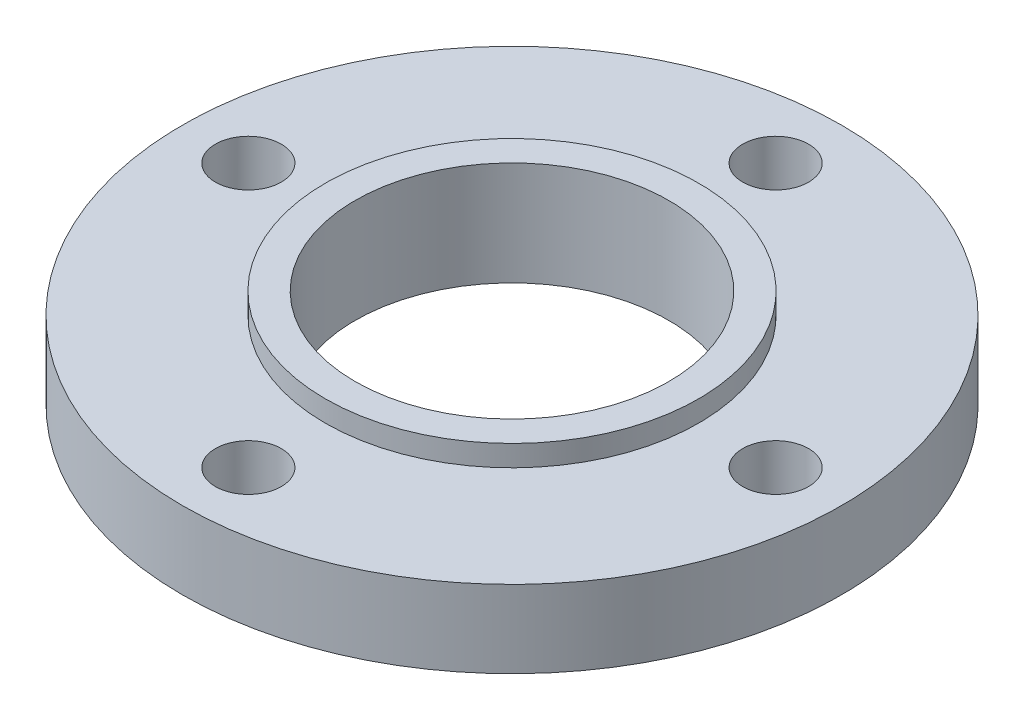
ISO-10303-21;
HEADER;
FILE_DESCRIPTION(('STEP AP214'),'2;1');
FILE_NAME('part.step','',(''),(''),'','','');
FILE_SCHEMA(('AUTOMOTIVE_DESIGN { 1 0 10303 214 1 1 1 1 }'));
ENDSEC;
DATA;
#1=APPLICATION_CONTEXT('core data for automotive mechanical design processes');
#2=APPLICATION_PROTOCOL_DEFINITION('international standard','automotive_design',2000,#1);
#3=PRODUCT_CONTEXT('',#1,'mechanical');
#4=PRODUCT('Part','Part','',(#3));
#5=PRODUCT_RELATED_PRODUCT_CATEGORY('part','',(#4));
#6=PRODUCT_DEFINITION_FORMATION('','',#4);
#7=PRODUCT_DEFINITION_CONTEXT('part definition',#1,'design');
#8=PRODUCT_DEFINITION('design','',#6,#7);
#9=PRODUCT_DEFINITION_SHAPE('','',#8);
#10=(LENGTH_UNIT() NAMED_UNIT(*) SI_UNIT(.MILLI.,.METRE.));
#11=(NAMED_UNIT(*) PLANE_ANGLE_UNIT() SI_UNIT($,.RADIAN.));
#12=(NAMED_UNIT(*) SI_UNIT($,.STERADIAN.) SOLID_ANGLE_UNIT());
#13=UNCERTAINTY_MEASURE_WITH_UNIT(LENGTH_MEASURE(1.E-05),#10,'distance_accuracy_value','');
#14=(GEOMETRIC_REPRESENTATION_CONTEXT(3) GLOBAL_UNCERTAINTY_ASSIGNED_CONTEXT((#13)) GLOBAL_UNIT_ASSIGNED_CONTEXT((#10,
#11,#12)) REPRESENTATION_CONTEXT('',''));
#15=CARTESIAN_POINT('',(0.,0.,0.));
#16=DIRECTION('',(0.,0.,1.));
#17=DIRECTION('',(1.,0.,0.));
#18=AXIS2_PLACEMENT_3D('',#15,#16,#17);
#19=CARTESIAN_POINT('',(0.,11.3909185591856,0.));
#20=DIRECTION('',(0.,-1.,0.));
#21=DIRECTION('',(0.,0.,-1.));
#22=AXIS2_PLACEMENT_3D('',#19,#20,#21);
#23=CYLINDRICAL_SURFACE('',#22,95.25);
#24=CARTESIAN_POINT('',(0.,11.3909185591856,0.));
#25=DIRECTION('',(0.,1.,0.));
#26=DIRECTION('',(0.,0.,1.));
#27=AXIS2_PLACEMENT_3D('',#24,#25,#26);
#28=CIRCLE('',#27,95.25);
#29=CARTESIAN_POINT('',(0.,11.3909185591856,95.25));
#30=VERTEX_POINT('',#29);
#31=EDGE_CURVE('E10',#30,#30,#28,.T.);
#32=ORIENTED_EDGE('',*,*,#31,.F.);
#33=EDGE_LOOP('',(#32));
#34=FACE_BOUND('',#33,.T.);
#35=CARTESIAN_POINT('',(0.,-10.9610814408144,0.));
#36=DIRECTION('',(0.,1.,0.));
#37=DIRECTION('',(0.,0.,1.));
#38=AXIS2_PLACEMENT_3D('',#35,#36,#37);
#39=CIRCLE('',#38,95.25);
#40=CARTESIAN_POINT('',(0.,-10.9610814408144,95.25));
#41=VERTEX_POINT('',#40);
#42=EDGE_CURVE('E41',#41,#41,#39,.T.);
#43=ORIENTED_EDGE('',*,*,#42,.T.);
#44=EDGE_LOOP('',(#43));
#45=FACE_BOUND('',#44,.T.);
#46=ADVANCED_FACE('F34',(#34,#45),#23,.T.);
#47=CARTESIAN_POINT('',(0.,11.3909185591856,0.));
#48=DIRECTION('',(0.,1.,0.));
#49=DIRECTION('',(0.,0.,1.));
#50=AXIS2_PLACEMENT_3D('',#47,#48,#49);
#51=PLANE('',#50);
#52=CARTESIAN_POINT('',(76.2,11.3909185591856,2.58381330109108E-13));
#53=DIRECTION('',(0.,1.,0.));
#54=DIRECTION('',(0.,0.,1.));
#55=AXIS2_PLACEMENT_3D('',#52,#53,#54);
#56=CIRCLE('',#55,9.525);
#57=CARTESIAN_POINT('',(76.2,11.3909185591856,9.52500000000026));
#58=VERTEX_POINT('',#57);
#59=EDGE_CURVE('E68',#58,#58,#56,.F.);
#60=ORIENTED_EDGE('',*,*,#59,.T.);
#61=EDGE_LOOP('',(#60));
#62=FACE_BOUND('',#61,.T.);
#63=CARTESIAN_POINT('',(0.,11.3909185591856,76.2));
#64=DIRECTION('',(0.,1.,0.));
#65=DIRECTION('',(0.,0.,1.));
#66=AXIS2_PLACEMENT_3D('',#63,#64,#65);
#67=CIRCLE('',#66,9.525);
#68=CARTESIAN_POINT('',(0.,11.3909185591856,85.725));
#69=VERTEX_POINT('',#68);
#70=EDGE_CURVE('E71',#69,#69,#67,.F.);
#71=ORIENTED_EDGE('',*,*,#70,.T.);
#72=EDGE_LOOP('',(#71));
#73=FACE_BOUND('',#72,.T.);
#74=CARTESIAN_POINT('',(-76.2,11.3909185591856,-8.05822181970279E-13));
#75=DIRECTION('',(0.,1.,0.));
#76=DIRECTION('',(0.,0.,1.));
#77=AXIS2_PLACEMENT_3D('',#74,#75,#76);
#78=CIRCLE('',#77,9.525);
#79=CARTESIAN_POINT('',(-76.2,11.3909185591856,9.52499999999919));
#80=VERTEX_POINT('',#79);
#81=EDGE_CURVE('E74',#80,#80,#78,.F.);
#82=ORIENTED_EDGE('',*,*,#81,.T.);
#83=EDGE_LOOP('',(#82));
#84=FACE_BOUND('',#83,.T.);
#85=CARTESIAN_POINT('',(0.,11.3909185591856,-76.2));
#86=DIRECTION('',(0.,1.,0.));
#87=DIRECTION('',(0.,0.,1.));
#88=AXIS2_PLACEMENT_3D('',#85,#86,#87);
#89=CIRCLE('',#88,9.525);
#90=CARTESIAN_POINT('',(0.,11.3909185591856,-66.675));
#91=VERTEX_POINT('',#90);
#92=EDGE_CURVE('E62',#91,#91,#89,.F.);
#93=ORIENTED_EDGE('',*,*,#92,.T.);
#94=EDGE_LOOP('',(#93));
#95=FACE_BOUND('',#94,.T.);
#96=CARTESIAN_POINT('',(0.,11.3909185591856,0.));
#97=DIRECTION('',(0.,1.,0.));
#98=DIRECTION('',(0.,0.,1.));
#99=AXIS2_PLACEMENT_3D('',#96,#97,#98);
#100=CIRCLE('',#99,53.975);
#101=CARTESIAN_POINT('',(0.,11.3909185591856,53.975));
#102=VERTEX_POINT('',#101);
#103=EDGE_CURVE('E46',#102,#102,#100,.F.);
#104=ORIENTED_EDGE('',*,*,#103,.T.);
#105=EDGE_LOOP('',(#104));
#106=FACE_BOUND('',#105,.T.);
#107=ORIENTED_EDGE('',*,*,#31,.T.);
#108=EDGE_LOOP('',(#107));
#109=FACE_BOUND('',#108,.T.);
#110=ADVANCED_FACE('F103',(#62,#73,#84,#95,#106,#109),#51,.T.);
#111=CARTESIAN_POINT('',(0.,-10.9610814408144,0.));
#112=DIRECTION('',(0.,1.,0.));
#113=DIRECTION('',(0.,0.,1.));
#114=AXIS2_PLACEMENT_3D('',#111,#112,#113);
#115=PLANE('',#114);
#116=CARTESIAN_POINT('',(76.2,-10.9610814408144,2.58381330109108E-13));
#117=DIRECTION('',(0.,1.,0.));
#118=DIRECTION('',(-1.,0.,0.));
#119=AXIS2_PLACEMENT_3D('',#116,#117,#118);
#120=CIRCLE('',#119,9.525);
#121=CARTESIAN_POINT('',(66.675,-10.9610814408144,2.25124970356627E-13));
#122=VERTEX_POINT('',#121);
#123=EDGE_CURVE('E77',#122,#122,#120,.T.);
#124=ORIENTED_EDGE('',*,*,#123,.T.);
#125=EDGE_LOOP('',(#124));
#126=FACE_BOUND('',#125,.T.);
#127=CARTESIAN_POINT('',(0.,-10.9610814408144,76.2));
#128=DIRECTION('',(0.,1.,0.));
#129=DIRECTION('',(0.,0.,-1.));
#130=AXIS2_PLACEMENT_3D('',#127,#128,#129);
#131=CIRCLE('',#130,9.525);
#132=CARTESIAN_POINT('',(0.,-10.9610814408144,66.675));
#133=VERTEX_POINT('',#132);
#134=EDGE_CURVE('E81',#133,#133,#131,.T.);
#135=ORIENTED_EDGE('',*,*,#134,.T.);
#136=EDGE_LOOP('',(#135));
#137=FACE_BOUND('',#136,.T.);
#138=CARTESIAN_POINT('',(-76.2,-10.9610814408144,-8.05822181970279E-13));
#139=DIRECTION('',(0.,1.,0.));
#140=DIRECTION('',(1.,0.,0.));
#141=AXIS2_PLACEMENT_3D('',#138,#139,#140);
#142=CIRCLE('',#141,9.525);
#143=CARTESIAN_POINT('',(-66.675,-10.9610814408144,-7.06053102712836E-13));
#144=VERTEX_POINT('',#143);
#145=EDGE_CURVE('E78',#144,#144,#142,.T.);
#146=ORIENTED_EDGE('',*,*,#145,.T.);
#147=EDGE_LOOP('',(#146));
#148=FACE_BOUND('',#147,.T.);
#149=CARTESIAN_POINT('',(0.,-10.9610814408144,-76.2));
#150=DIRECTION('',(0.,1.,0.));
#151=DIRECTION('',(0.,0.,1.));
#152=AXIS2_PLACEMENT_3D('',#149,#150,#151);
#153=CIRCLE('',#152,9.525);
#154=CARTESIAN_POINT('',(0.,-10.9610814408144,-66.675));
#155=VERTEX_POINT('',#154);
#156=EDGE_CURVE('E65',#155,#155,#153,.T.);
#157=ORIENTED_EDGE('',*,*,#156,.T.);
#158=EDGE_LOOP('',(#157));
#159=FACE_BOUND('',#158,.T.);
#160=CARTESIAN_POINT('',(0.,-10.9610814408144,0.));
#161=DIRECTION('',(0.,1.,0.));
#162=DIRECTION('',(0.,0.,1.));
#163=AXIS2_PLACEMENT_3D('',#160,#161,#162);
#164=CIRCLE('',#163,63.5);
#165=CARTESIAN_POINT('',(0.,-10.9610814408144,63.5));
#166=VERTEX_POINT('',#165);
#167=EDGE_CURVE('E54',#166,#166,#164,.T.);
#168=ORIENTED_EDGE('',*,*,#167,.T.);
#169=EDGE_LOOP('',(#168));
#170=FACE_BOUND('',#169,.T.);
#171=ORIENTED_EDGE('',*,*,#42,.F.);
#172=EDGE_LOOP('',(#171));
#173=FACE_BOUND('',#172,.T.);
#174=ADVANCED_FACE('F87',(#126,#137,#148,#159,#170,#173),#115,.F.);
#175=CARTESIAN_POINT('',(0.,17.4869185591856,0.));
#176=DIRECTION('',(0.,-1.,0.));
#177=DIRECTION('',(0.,0.,-1.));
#178=AXIS2_PLACEMENT_3D('',#175,#176,#177);
#179=CYLINDRICAL_SURFACE('',#178,53.975);
#180=ORIENTED_EDGE('',*,*,#103,.F.);
#181=EDGE_LOOP('',(#180));
#182=FACE_BOUND('',#181,.T.);
#183=CARTESIAN_POINT('',(0.,17.4869185591856,0.));
#184=DIRECTION('',(0.,1.,0.));
#185=DIRECTION('',(0.,0.,1.));
#186=AXIS2_PLACEMENT_3D('',#183,#184,#185);
#187=CIRCLE('',#186,53.975);
#188=CARTESIAN_POINT('',(0.,17.4869185591856,53.975));
#189=VERTEX_POINT('',#188);
#190=EDGE_CURVE('E50',#189,#189,#187,.T.);
#191=ORIENTED_EDGE('',*,*,#190,.F.);
#192=EDGE_LOOP('',(#191));
#193=FACE_BOUND('',#192,.T.);
#194=ADVANCED_FACE('F114',(#182,#193),#179,.T.);
#195=CARTESIAN_POINT('',(0.,17.4869185591856,0.));
#196=DIRECTION('',(0.,1.,0.));
#197=DIRECTION('',(0.,0.,1.));
#198=AXIS2_PLACEMENT_3D('',#195,#196,#197);
#199=PLANE('',#198);
#200=CARTESIAN_POINT('',(0.,17.4869185591856,0.));
#201=DIRECTION('',(0.,1.,0.));
#202=DIRECTION('',(0.,0.,1.));
#203=AXIS2_PLACEMENT_3D('',#200,#201,#202);
#204=CIRCLE('',#203,45.339);
#205=CARTESIAN_POINT('',(0.,17.4869185591856,45.339));
#206=VERTEX_POINT('',#205);
#207=EDGE_CURVE('E57',#206,#206,#204,.F.);
#208=ORIENTED_EDGE('',*,*,#207,.T.);
#209=EDGE_LOOP('',(#208));
#210=FACE_BOUND('',#209,.T.);
#211=ORIENTED_EDGE('',*,*,#190,.T.);
#212=EDGE_LOOP('',(#211));
#213=FACE_BOUND('',#212,.T.);
#214=ADVANCED_FACE('F118',(#210,#213),#199,.T.);
#215=CARTESIAN_POINT('',(0.,-12.5485814408144,0.));
#216=DIRECTION('',(0.,1.,0.));
#217=DIRECTION('',(0.,0.,1.));
#218=AXIS2_PLACEMENT_3D('',#215,#216,#217);
#219=CYLINDRICAL_SURFACE('',#218,63.5);
#220=CARTESIAN_POINT('',(0.,-12.5485814408144,0.));
#221=DIRECTION('',(0.,1.,0.));
#222=DIRECTION('',(0.,0.,1.));
#223=AXIS2_PLACEMENT_3D('',#220,#221,#222);
#224=CIRCLE('',#223,63.5);
#225=CARTESIAN_POINT('',(0.,-12.5485814408144,63.5));
#226=VERTEX_POINT('',#225);
#227=EDGE_CURVE('E53',#226,#226,#224,.T.);
#228=ORIENTED_EDGE('',*,*,#227,.T.);
#229=EDGE_LOOP('',(#228));
#230=FACE_BOUND('',#229,.T.);
#231=ORIENTED_EDGE('',*,*,#167,.F.);
#232=EDGE_LOOP('',(#231));
#233=FACE_BOUND('',#232,.T.);
#234=ADVANCED_FACE('F124',(#230,#233),#219,.T.);
#235=CARTESIAN_POINT('',(0.,-12.5485814408144,0.));
#236=DIRECTION('',(0.,1.,0.));
#237=DIRECTION('',(0.,0.,1.));
#238=AXIS2_PLACEMENT_3D('',#235,#236,#237);
#239=PLANE('',#238);
#240=CARTESIAN_POINT('',(0.,-12.5485814408144,0.));
#241=DIRECTION('',(0.,1.,0.));
#242=DIRECTION('',(0.,0.,1.));
#243=AXIS2_PLACEMENT_3D('',#240,#241,#242);
#244=CIRCLE('',#243,45.339);
#245=CARTESIAN_POINT('',(0.,-12.5485814408144,45.339));
#246=VERTEX_POINT('',#245);
#247=EDGE_CURVE('E37',#246,#246,#244,.F.);
#248=ORIENTED_EDGE('',*,*,#247,.F.);
#249=EDGE_LOOP('',(#248));
#250=FACE_BOUND('',#249,.T.);
#251=ORIENTED_EDGE('',*,*,#227,.F.);
#252=EDGE_LOOP('',(#251));
#253=FACE_BOUND('',#252,.T.);
#254=ADVANCED_FACE('F128',(#250,#253),#239,.F.);
#255=CARTESIAN_POINT('',(0.,65.2389185591856,0.));
#256=DIRECTION('',(0.,-1.,0.));
#257=DIRECTION('',(0.,0.,-1.));
#258=AXIS2_PLACEMENT_3D('',#255,#256,#257);
#259=CYLINDRICAL_SURFACE('',#258,45.339);
#260=ORIENTED_EDGE('',*,*,#207,.F.);
#261=EDGE_LOOP('',(#260));
#262=FACE_BOUND('',#261,.T.);
#263=ORIENTED_EDGE('',*,*,#247,.T.);
#264=EDGE_LOOP('',(#263));
#265=FACE_BOUND('',#264,.T.);
#266=ADVANCED_FACE('F132',(#262,#265),#259,.F.);
#267=CARTESIAN_POINT('',(0.,66.8264185591856,-76.2));
#268=DIRECTION('',(0.,-1.,0.));
#269=DIRECTION('',(0.,0.,-1.));
#270=AXIS2_PLACEMENT_3D('',#267,#268,#269);
#271=CYLINDRICAL_SURFACE('',#270,9.525);
#272=ORIENTED_EDGE('',*,*,#92,.F.);
#273=EDGE_LOOP('',(#272));
#274=FACE_BOUND('',#273,.T.);
#275=ORIENTED_EDGE('',*,*,#156,.F.);
#276=EDGE_LOOP('',(#275));
#277=FACE_BOUND('',#276,.T.);
#278=ADVANCED_FACE('F136',(#274,#277),#271,.F.);
#279=CARTESIAN_POINT('',(-76.2,66.8264185591856,-8.05822181970279E-13));
#280=DIRECTION('',(0.,-1.,0.));
#281=DIRECTION('',(0.,0.,-1.));
#282=AXIS2_PLACEMENT_3D('',#279,#280,#281);
#283=CYLINDRICAL_SURFACE('',#282,9.525);
#284=ORIENTED_EDGE('',*,*,#81,.F.);
#285=EDGE_LOOP('',(#284));
#286=FACE_BOUND('',#285,.T.);
#287=ORIENTED_EDGE('',*,*,#145,.F.);
#288=EDGE_LOOP('',(#287));
#289=FACE_BOUND('',#288,.T.);
#290=ADVANCED_FACE('F98',(#286,#289),#283,.F.);
#291=CARTESIAN_POINT('',(0.,66.8264185591856,76.2));
#292=DIRECTION('',(0.,-1.,0.));
#293=DIRECTION('',(0.,0.,-1.));
#294=AXIS2_PLACEMENT_3D('',#291,#292,#293);
#295=CYLINDRICAL_SURFACE('',#294,9.525);
#296=ORIENTED_EDGE('',*,*,#70,.F.);
#297=EDGE_LOOP('',(#296));
#298=FACE_BOUND('',#297,.T.);
#299=ORIENTED_EDGE('',*,*,#134,.F.);
#300=EDGE_LOOP('',(#299));
#301=FACE_BOUND('',#300,.T.);
#302=ADVANCED_FACE('F92',(#298,#301),#295,.F.);
#303=CARTESIAN_POINT('',(76.2,66.8264185591856,2.58381330109108E-13));
#304=DIRECTION('',(0.,-1.,0.));
#305=DIRECTION('',(0.,0.,-1.));
#306=AXIS2_PLACEMENT_3D('',#303,#304,#305);
#307=CYLINDRICAL_SURFACE('',#306,9.525);
#308=ORIENTED_EDGE('',*,*,#59,.F.);
#309=EDGE_LOOP('',(#308));
#310=FACE_BOUND('',#309,.T.);
#311=ORIENTED_EDGE('',*,*,#123,.F.);
#312=EDGE_LOOP('',(#311));
#313=FACE_BOUND('',#312,.T.);
#314=ADVANCED_FACE('F90',(#310,#313),#307,.F.);
#315=CLOSED_SHELL('',(#46,#110,#174,#194,#214,#234,#254,#266,#278,#290,#302,#314));
#316=MANIFOLD_SOLID_BREP('B2',#315);
#317=ADVANCED_BREP_SHAPE_REPRESENTATION('',(#18,#316),#14);
#318=SHAPE_DEFINITION_REPRESENTATION(#9,#317);
ENDSEC;
END-ISO-10303-21;
